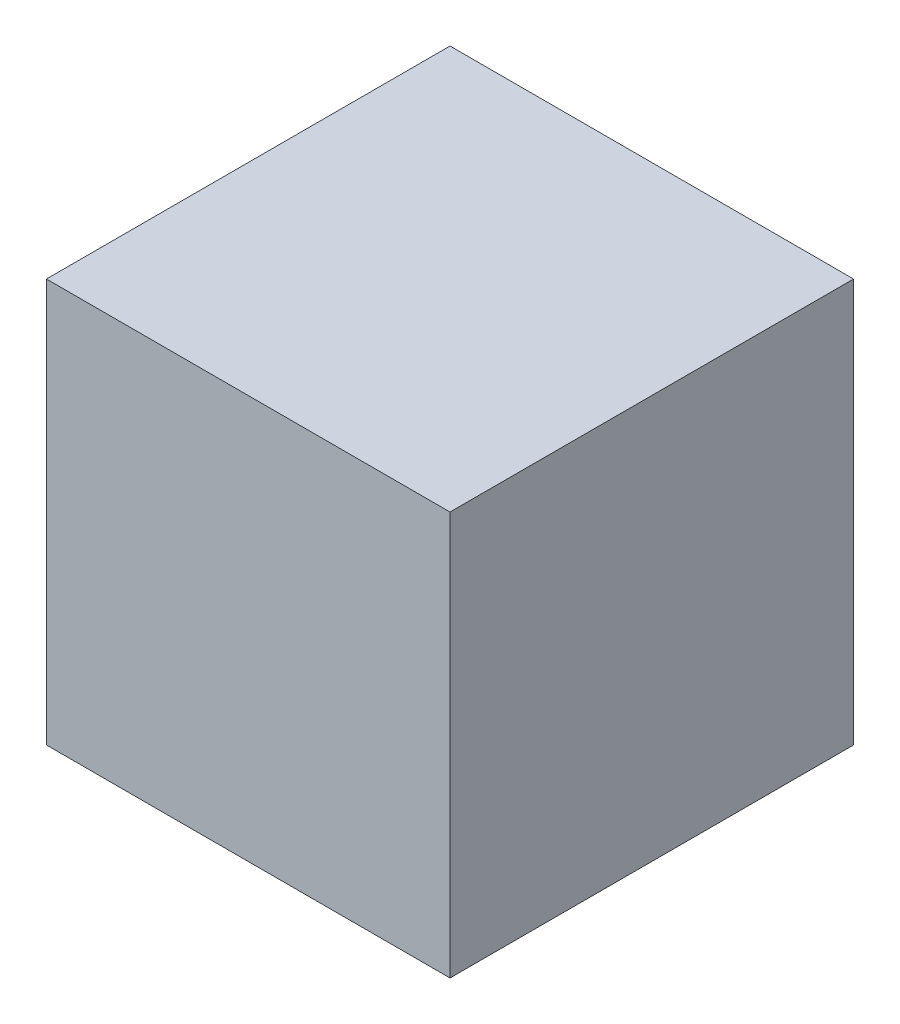
ISO-10303-21;
HEADER;
FILE_DESCRIPTION(('STEP AP214'),'2;1');
FILE_NAME('part.step','',(''),(''),'','','');
FILE_SCHEMA(('AUTOMOTIVE_DESIGN { 1 0 10303 214 1 1 1 1 }'));
ENDSEC;
DATA;
#1=APPLICATION_CONTEXT('core data for automotive mechanical design processes');
#2=APPLICATION_PROTOCOL_DEFINITION('international standard','automotive_design',2000,#1);
#3=PRODUCT_CONTEXT('',#1,'mechanical');
#4=PRODUCT('Part','Part','',(#3));
#5=PRODUCT_RELATED_PRODUCT_CATEGORY('part','',(#4));
#6=PRODUCT_DEFINITION_FORMATION('','',#4);
#7=PRODUCT_DEFINITION_CONTEXT('part definition',#1,'design');
#8=PRODUCT_DEFINITION('design','',#6,#7);
#9=PRODUCT_DEFINITION_SHAPE('','',#8);
#10=(LENGTH_UNIT() NAMED_UNIT(*) SI_UNIT(.MILLI.,.METRE.));
#11=(NAMED_UNIT(*) PLANE_ANGLE_UNIT() SI_UNIT($,.RADIAN.));
#12=(NAMED_UNIT(*) SI_UNIT($,.STERADIAN.) SOLID_ANGLE_UNIT());
#13=UNCERTAINTY_MEASURE_WITH_UNIT(LENGTH_MEASURE(1.E-05),#10,'distance_accuracy_value','');
#14=(GEOMETRIC_REPRESENTATION_CONTEXT(3) GLOBAL_UNCERTAINTY_ASSIGNED_CONTEXT((#13)) GLOBAL_UNIT_ASSIGNED_CONTEXT((#10,
#11,#12)) REPRESENTATION_CONTEXT('',''));
#15=CARTESIAN_POINT('',(0.,0.,0.));
#16=DIRECTION('',(0.,0.,1.));
#17=DIRECTION('',(1.,0.,0.));
#18=AXIS2_PLACEMENT_3D('',#15,#16,#17);
#19=CARTESIAN_POINT('',(-76.2,152.4,76.2));
#20=DIRECTION('',(1.,0.,0.));
#21=DIRECTION('',(0.,0.,-1.));
#22=AXIS2_PLACEMENT_3D('',#19,#20,#21);
#23=PLANE('',#22);
#24=DIRECTION('',(0.,0.,1.));
#25=VECTOR('',#24,1.);
#26=CARTESIAN_POINT('',(-76.2,0.,76.2));
#27=LINE('',#26,#25);
#28=CARTESIAN_POINT('',(-76.2,0.,-76.2));
#29=VERTEX_POINT('',#28);
#30=CARTESIAN_POINT('',(-76.2,0.,76.2));
#31=VERTEX_POINT('',#30);
#32=EDGE_CURVE('E97',#29,#31,#27,.T.);
#33=ORIENTED_EDGE('',*,*,#32,.T.);
#34=DIRECTION('',(0.,-1.,0.));
#35=VECTOR('',#34,1.);
#36=CARTESIAN_POINT('',(-76.2,152.4,76.2));
#37=LINE('',#36,#35);
#38=CARTESIAN_POINT('',(-76.2,152.4,76.2));
#39=VERTEX_POINT('',#38);
#40=EDGE_CURVE('E11',#39,#31,#37,.T.);
#41=ORIENTED_EDGE('',*,*,#40,.F.);
#42=DIRECTION('',(0.,0.,1.));
#43=VECTOR('',#42,1.);
#44=CARTESIAN_POINT('',(-76.2,152.4,76.2));
#45=LINE('',#44,#43);
#46=CARTESIAN_POINT('',(-76.2,152.4,-76.2));
#47=VERTEX_POINT('',#46);
#48=EDGE_CURVE('E85',#47,#39,#45,.T.);
#49=ORIENTED_EDGE('',*,*,#48,.F.);
#50=DIRECTION('',(0.,-1.,0.));
#51=VECTOR('',#50,1.);
#52=CARTESIAN_POINT('',(-76.2,152.4,-76.2));
#53=LINE('',#52,#51);
#54=EDGE_CURVE('E93',#47,#29,#53,.T.);
#55=ORIENTED_EDGE('',*,*,#54,.T.);
#56=EDGE_LOOP('',(#33,#41,#49,#55));
#57=FACE_BOUND('',#56,.T.);
#58=ADVANCED_FACE('F34',(#57),#23,.F.);
#59=CARTESIAN_POINT('',(76.2,152.4,76.2));
#60=DIRECTION('',(0.,0.,-1.));
#61=DIRECTION('',(-1.,0.,0.));
#62=AXIS2_PLACEMENT_3D('',#59,#60,#61);
#63=PLANE('',#62);
#64=DIRECTION('',(1.,0.,0.));
#65=VECTOR('',#64,1.);
#66=CARTESIAN_POINT('',(76.2,0.,76.2));
#67=LINE('',#66,#65);
#68=CARTESIAN_POINT('',(76.2,0.,76.2));
#69=VERTEX_POINT('',#68);
#70=EDGE_CURVE('E89',#31,#69,#67,.T.);
#71=ORIENTED_EDGE('',*,*,#70,.T.);
#72=DIRECTION('',(0.,-1.,0.));
#73=VECTOR('',#72,1.);
#74=CARTESIAN_POINT('',(76.2,152.4,76.2));
#75=LINE('',#74,#73);
#76=CARTESIAN_POINT('',(76.2,152.4,76.2));
#77=VERTEX_POINT('',#76);
#78=EDGE_CURVE('E42',#77,#69,#75,.T.);
#79=ORIENTED_EDGE('',*,*,#78,.F.);
#80=DIRECTION('',(1.,0.,0.));
#81=VECTOR('',#80,1.);
#82=CARTESIAN_POINT('',(76.2,152.4,76.2));
#83=LINE('',#82,#81);
#84=EDGE_CURVE('E80',#39,#77,#83,.T.);
#85=ORIENTED_EDGE('',*,*,#84,.F.);
#86=ORIENTED_EDGE('',*,*,#40,.T.);
#87=EDGE_LOOP('',(#71,#79,#85,#86));
#88=FACE_BOUND('',#87,.T.);
#89=ADVANCED_FACE('F88',(#88),#63,.F.);
#90=CARTESIAN_POINT('',(76.2,152.4,76.2));
#91=DIRECTION('',(-1.,0.,0.));
#92=DIRECTION('',(0.,0.,1.));
#93=AXIS2_PLACEMENT_3D('',#90,#91,#92);
#94=PLANE('',#93);
#95=DIRECTION('',(0.,0.,-1.));
#96=VECTOR('',#95,1.);
#97=CARTESIAN_POINT('',(76.2,0.,76.2));
#98=LINE('',#97,#96);
#99=CARTESIAN_POINT('',(76.2,0.,-76.2));
#100=VERTEX_POINT('',#99);
#101=EDGE_CURVE('E67',#69,#100,#98,.T.);
#102=ORIENTED_EDGE('',*,*,#101,.T.);
#103=DIRECTION('',(0.,-1.,0.));
#104=VECTOR('',#103,1.);
#105=CARTESIAN_POINT('',(76.2,152.4,-76.2));
#106=LINE('',#105,#104);
#107=CARTESIAN_POINT('',(76.2,152.4,-76.2));
#108=VERTEX_POINT('',#107);
#109=EDGE_CURVE('E90',#108,#100,#106,.T.);
#110=ORIENTED_EDGE('',*,*,#109,.F.);
#111=DIRECTION('',(0.,0.,-1.));
#112=VECTOR('',#111,1.);
#113=CARTESIAN_POINT('',(76.2,152.4,76.2));
#114=LINE('',#113,#112);
#115=EDGE_CURVE('E83',#77,#108,#114,.T.);
#116=ORIENTED_EDGE('',*,*,#115,.F.);
#117=ORIENTED_EDGE('',*,*,#78,.T.);
#118=EDGE_LOOP('',(#102,#110,#116,#117));
#119=FACE_BOUND('',#118,.T.);
#120=ADVANCED_FACE('F91',(#119),#94,.F.);
#121=CARTESIAN_POINT('',(76.2,152.4,-76.2));
#122=DIRECTION('',(0.,0.,1.));
#123=DIRECTION('',(1.,0.,0.));
#124=AXIS2_PLACEMENT_3D('',#121,#122,#123);
#125=PLANE('',#124);
#126=DIRECTION('',(-1.,0.,0.));
#127=VECTOR('',#126,1.);
#128=CARTESIAN_POINT('',(76.2,0.,-76.2));
#129=LINE('',#128,#127);
#130=EDGE_CURVE('E73',#100,#29,#129,.T.);
#131=ORIENTED_EDGE('',*,*,#130,.T.);
#132=ORIENTED_EDGE('',*,*,#54,.F.);
#133=DIRECTION('',(-1.,0.,0.));
#134=VECTOR('',#133,1.);
#135=CARTESIAN_POINT('',(76.2,152.4,-76.2));
#136=LINE('',#135,#134);
#137=EDGE_CURVE('E50',#108,#47,#136,.T.);
#138=ORIENTED_EDGE('',*,*,#137,.F.);
#139=ORIENTED_EDGE('',*,*,#109,.T.);
#140=EDGE_LOOP('',(#131,#132,#138,#139));
#141=FACE_BOUND('',#140,.T.);
#142=ADVANCED_FACE('F104',(#141),#125,.F.);
#143=CARTESIAN_POINT('',(0.,152.4,0.));
#144=DIRECTION('',(0.,1.,0.));
#145=DIRECTION('',(0.,0.,1.));
#146=AXIS2_PLACEMENT_3D('',#143,#144,#145);
#147=PLANE('',#146);
#148=ORIENTED_EDGE('',*,*,#48,.T.);
#149=ORIENTED_EDGE('',*,*,#84,.T.);
#150=ORIENTED_EDGE('',*,*,#115,.T.);
#151=ORIENTED_EDGE('',*,*,#137,.T.);
#152=EDGE_LOOP('',(#148,#149,#150,#151));
#153=FACE_BOUND('',#152,.T.);
#154=ADVANCED_FACE('F81',(#153),#147,.T.);
#155=CARTESIAN_POINT('',(0.,0.,0.));
#156=DIRECTION('',(0.,1.,0.));
#157=DIRECTION('',(0.,0.,1.));
#158=AXIS2_PLACEMENT_3D('',#155,#156,#157);
#159=PLANE('',#158);
#160=ORIENTED_EDGE('',*,*,#32,.F.);
#161=ORIENTED_EDGE('',*,*,#130,.F.);
#162=ORIENTED_EDGE('',*,*,#101,.F.);
#163=ORIENTED_EDGE('',*,*,#70,.F.);
#164=EDGE_LOOP('',(#160,#161,#162,#163));
#165=FACE_BOUND('',#164,.T.);
#166=ADVANCED_FACE('F107',(#165),#159,.F.);
#167=CLOSED_SHELL('',(#58,#89,#120,#142,#154,#166));
#168=MANIFOLD_SOLID_BREP('B2',#167);
#169=ADVANCED_BREP_SHAPE_REPRESENTATION('',(#18,#168),#14);
#170=SHAPE_DEFINITION_REPRESENTATION(#9,#169);
ENDSEC;
END-ISO-10303-21;
